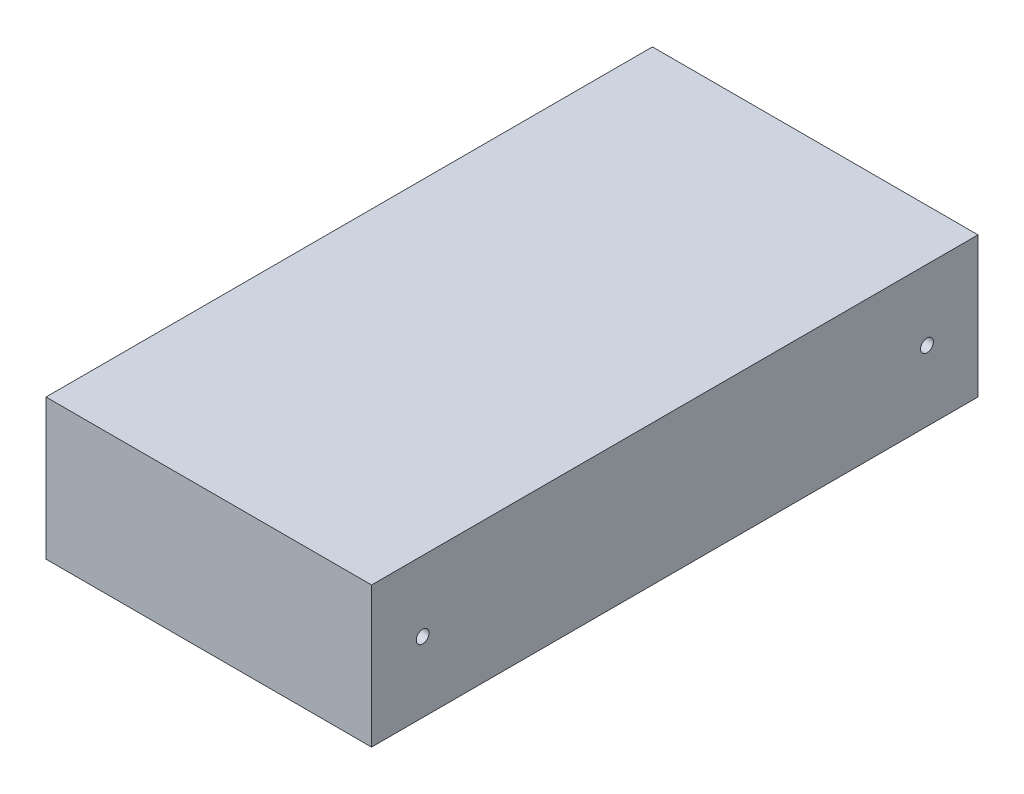
ISO-10303-21;
HEADER;
FILE_DESCRIPTION(('STEP AP214'),'2;1');
FILE_NAME('part.step','',(''),(''),'','','');
FILE_SCHEMA(('AUTOMOTIVE_DESIGN { 1 0 10303 214 1 1 1 1 }'));
ENDSEC;
DATA;
#1=APPLICATION_CONTEXT('core data for automotive mechanical design processes');
#2=APPLICATION_PROTOCOL_DEFINITION('international standard','automotive_design',2000,#1);
#3=PRODUCT_CONTEXT('',#1,'mechanical');
#4=PRODUCT('Part','Part','',(#3));
#5=PRODUCT_RELATED_PRODUCT_CATEGORY('part','',(#4));
#6=PRODUCT_DEFINITION_FORMATION('','',#4);
#7=PRODUCT_DEFINITION_CONTEXT('part definition',#1,'design');
#8=PRODUCT_DEFINITION('design','',#6,#7);
#9=PRODUCT_DEFINITION_SHAPE('','',#8);
#10=(LENGTH_UNIT() NAMED_UNIT(*) SI_UNIT(.MILLI.,.METRE.));
#11=(NAMED_UNIT(*) PLANE_ANGLE_UNIT() SI_UNIT($,.RADIAN.));
#12=(NAMED_UNIT(*) SI_UNIT($,.STERADIAN.) SOLID_ANGLE_UNIT());
#13=UNCERTAINTY_MEASURE_WITH_UNIT(LENGTH_MEASURE(1.E-05),#10,'distance_accuracy_value','');
#14=(GEOMETRIC_REPRESENTATION_CONTEXT(3) GLOBAL_UNCERTAINTY_ASSIGNED_CONTEXT((#13)) GLOBAL_UNIT_ASSIGNED_CONTEXT((#10,
#11,#12)) REPRESENTATION_CONTEXT('',''));
#15=CARTESIAN_POINT('',(0.,0.,0.));
#16=DIRECTION('',(0.,0.,1.));
#17=DIRECTION('',(1.,0.,0.));
#18=AXIS2_PLACEMENT_3D('',#15,#16,#17);
#19=CARTESIAN_POINT('',(-25.5,22.,47.5));
#20=DIRECTION('',(0.,0.,-1.));
#21=DIRECTION('',(-1.,0.,0.));
#22=AXIS2_PLACEMENT_3D('',#19,#20,#21);
#23=PLANE('',#22);
#24=DIRECTION('',(1.,0.,0.));
#25=VECTOR('',#24,1.);
#26=CARTESIAN_POINT('',(-25.5,0.,47.5));
#27=LINE('',#26,#25);
#28=CARTESIAN_POINT('',(-25.5,0.,47.5));
#29=VERTEX_POINT('',#28);
#30=CARTESIAN_POINT('',(25.5,0.,47.5));
#31=VERTEX_POINT('',#30);
#32=EDGE_CURVE('E107',#29,#31,#27,.T.);
#33=ORIENTED_EDGE('',*,*,#32,.T.);
#34=DIRECTION('',(0.,-1.,0.));
#35=VECTOR('',#34,1.);
#36=CARTESIAN_POINT('',(25.5,22.,47.5));
#37=LINE('',#36,#35);
#38=CARTESIAN_POINT('',(25.5,22.,47.5));
#39=VERTEX_POINT('',#38);
#40=EDGE_CURVE('E11',#39,#31,#37,.T.);
#41=ORIENTED_EDGE('',*,*,#40,.F.);
#42=DIRECTION('',(1.,0.,0.));
#43=VECTOR('',#42,1.);
#44=CARTESIAN_POINT('',(-25.5,22.,47.5));
#45=LINE('',#44,#43);
#46=CARTESIAN_POINT('',(-25.5,22.,47.5));
#47=VERTEX_POINT('',#46);
#48=EDGE_CURVE('E91',#47,#39,#45,.T.);
#49=ORIENTED_EDGE('',*,*,#48,.F.);
#50=DIRECTION('',(0.,-1.,0.));
#51=VECTOR('',#50,1.);
#52=CARTESIAN_POINT('',(-25.5,22.,47.5));
#53=LINE('',#52,#51);
#54=EDGE_CURVE('E103',#47,#29,#53,.T.);
#55=ORIENTED_EDGE('',*,*,#54,.T.);
#56=EDGE_LOOP('',(#33,#41,#49,#55));
#57=FACE_BOUND('',#56,.T.);
#58=ADVANCED_FACE('F39',(#57),#23,.F.);
#59=CARTESIAN_POINT('',(25.5,22.,47.5));
#60=DIRECTION('',(-1.,0.,0.));
#61=DIRECTION('',(0.,0.,1.));
#62=AXIS2_PLACEMENT_3D('',#59,#60,#61);
#63=PLANE('',#62);
#64=CARTESIAN_POINT('',(25.5,11.,-39.5));
#65=DIRECTION('',(-1.,0.,0.));
#66=DIRECTION('',(0.,0.,1.));
#67=AXIS2_PLACEMENT_3D('',#64,#65,#66);
#68=CIRCLE('',#67,0.999999999999998);
#69=CARTESIAN_POINT('',(25.5,11.,-38.5));
#70=VERTEX_POINT('',#69);
#71=EDGE_CURVE('E135',#70,#70,#68,.T.);
#72=ORIENTED_EDGE('',*,*,#71,.T.);
#73=EDGE_LOOP('',(#72));
#74=FACE_BOUND('',#73,.T.);
#75=CARTESIAN_POINT('',(25.5,11.,39.5));
#76=DIRECTION('',(1.,0.,0.));
#77=DIRECTION('',(0.,0.,-1.));
#78=AXIS2_PLACEMENT_3D('',#75,#76,#77);
#79=CIRCLE('',#78,0.999999999999998);
#80=CARTESIAN_POINT('',(25.5,11.,38.5));
#81=VERTEX_POINT('',#80);
#82=EDGE_CURVE('E131',#81,#81,#79,.T.);
#83=ORIENTED_EDGE('',*,*,#82,.F.);
#84=EDGE_LOOP('',(#83));
#85=FACE_BOUND('',#84,.T.);
#86=DIRECTION('',(0.,0.,-1.));
#87=VECTOR('',#86,1.);
#88=CARTESIAN_POINT('',(25.5,0.,47.5));
#89=LINE('',#88,#87);
#90=CARTESIAN_POINT('',(25.5,0.,-47.5));
#91=VERTEX_POINT('',#90);
#92=EDGE_CURVE('E96',#31,#91,#89,.T.);
#93=ORIENTED_EDGE('',*,*,#92,.T.);
#94=DIRECTION('',(0.,-1.,0.));
#95=VECTOR('',#94,1.);
#96=CARTESIAN_POINT('',(25.5,22.,-47.5));
#97=LINE('',#96,#95);
#98=CARTESIAN_POINT('',(25.5,22.,-47.5));
#99=VERTEX_POINT('',#98);
#100=EDGE_CURVE('E48',#99,#91,#97,.T.);
#101=ORIENTED_EDGE('',*,*,#100,.F.);
#102=DIRECTION('',(0.,0.,-1.));
#103=VECTOR('',#102,1.);
#104=CARTESIAN_POINT('',(25.5,22.,47.5));
#105=LINE('',#104,#103);
#106=EDGE_CURVE('E86',#39,#99,#105,.T.);
#107=ORIENTED_EDGE('',*,*,#106,.F.);
#108=ORIENTED_EDGE('',*,*,#40,.T.);
#109=EDGE_LOOP('',(#93,#101,#107,#108));
#110=FACE_BOUND('',#109,.T.);
#111=ADVANCED_FACE('F95',(#74,#85,#110),#63,.F.);
#112=CARTESIAN_POINT('',(-25.5,22.,-47.5));
#113=DIRECTION('',(0.,0.,1.));
#114=DIRECTION('',(1.,0.,0.));
#115=AXIS2_PLACEMENT_3D('',#112,#113,#114);
#116=PLANE('',#115);
#117=DIRECTION('',(-1.,0.,0.));
#118=VECTOR('',#117,1.);
#119=CARTESIAN_POINT('',(-25.5,0.,-47.5));
#120=LINE('',#119,#118);
#121=CARTESIAN_POINT('',(-25.5,0.,-47.5));
#122=VERTEX_POINT('',#121);
#123=EDGE_CURVE('E73',#91,#122,#120,.T.);
#124=ORIENTED_EDGE('',*,*,#123,.T.);
#125=DIRECTION('',(0.,-1.,0.));
#126=VECTOR('',#125,1.);
#127=CARTESIAN_POINT('',(-25.5,22.,-47.5));
#128=LINE('',#127,#126);
#129=CARTESIAN_POINT('',(-25.5,22.,-47.5));
#130=VERTEX_POINT('',#129);
#131=EDGE_CURVE('E98',#130,#122,#128,.T.);
#132=ORIENTED_EDGE('',*,*,#131,.F.);
#133=DIRECTION('',(-1.,0.,0.));
#134=VECTOR('',#133,1.);
#135=CARTESIAN_POINT('',(-25.5,22.,-47.5));
#136=LINE('',#135,#134);
#137=EDGE_CURVE('E89',#99,#130,#136,.T.);
#138=ORIENTED_EDGE('',*,*,#137,.F.);
#139=ORIENTED_EDGE('',*,*,#100,.T.);
#140=EDGE_LOOP('',(#124,#132,#138,#139));
#141=FACE_BOUND('',#140,.T.);
#142=ADVANCED_FACE('F99',(#141),#116,.F.);
#143=CARTESIAN_POINT('',(-25.5,22.,47.5));
#144=DIRECTION('',(1.,0.,0.));
#145=DIRECTION('',(0.,0.,-1.));
#146=AXIS2_PLACEMENT_3D('',#143,#144,#145);
#147=PLANE('',#146);
#148=CARTESIAN_POINT('',(-25.5,11.,-39.5));
#149=DIRECTION('',(1.,0.,0.));
#150=DIRECTION('',(0.,0.,-1.));
#151=AXIS2_PLACEMENT_3D('',#148,#149,#150);
#152=CIRCLE('',#151,0.999999999999998);
#153=CARTESIAN_POINT('',(-25.5,11.,-40.5));
#154=VERTEX_POINT('',#153);
#155=EDGE_CURVE('E136',#154,#154,#152,.T.);
#156=ORIENTED_EDGE('',*,*,#155,.T.);
#157=EDGE_LOOP('',(#156));
#158=FACE_BOUND('',#157,.T.);
#159=CARTESIAN_POINT('',(-25.5,11.,39.5));
#160=DIRECTION('',(1.,0.,0.));
#161=DIRECTION('',(0.,0.,-1.));
#162=AXIS2_PLACEMENT_3D('',#159,#160,#161);
#163=CIRCLE('',#162,0.999999999999998);
#164=CARTESIAN_POINT('',(-25.5,11.,38.5));
#165=VERTEX_POINT('',#164);
#166=EDGE_CURVE('E111',#165,#165,#163,.F.);
#167=ORIENTED_EDGE('',*,*,#166,.F.);
#168=EDGE_LOOP('',(#167));
#169=FACE_BOUND('',#168,.T.);
#170=DIRECTION('',(0.,0.,1.));
#171=VECTOR('',#170,1.);
#172=CARTESIAN_POINT('',(-25.5,0.,47.5));
#173=LINE('',#172,#171);
#174=EDGE_CURVE('E79',#122,#29,#173,.T.);
#175=ORIENTED_EDGE('',*,*,#174,.T.);
#176=ORIENTED_EDGE('',*,*,#54,.F.);
#177=DIRECTION('',(0.,0.,1.));
#178=VECTOR('',#177,1.);
#179=CARTESIAN_POINT('',(-25.5,22.,47.5));
#180=LINE('',#179,#178);
#181=EDGE_CURVE('E56',#130,#47,#180,.T.);
#182=ORIENTED_EDGE('',*,*,#181,.F.);
#183=ORIENTED_EDGE('',*,*,#131,.T.);
#184=EDGE_LOOP('',(#175,#176,#182,#183));
#185=FACE_BOUND('',#184,.T.);
#186=ADVANCED_FACE('F121',(#158,#169,#185),#147,.F.);
#187=CARTESIAN_POINT('',(0.,22.,0.));
#188=DIRECTION('',(0.,1.,0.));
#189=DIRECTION('',(0.,0.,1.));
#190=AXIS2_PLACEMENT_3D('',#187,#188,#189);
#191=PLANE('',#190);
#192=ORIENTED_EDGE('',*,*,#48,.T.);
#193=ORIENTED_EDGE('',*,*,#106,.T.);
#194=ORIENTED_EDGE('',*,*,#137,.T.);
#195=ORIENTED_EDGE('',*,*,#181,.T.);
#196=EDGE_LOOP('',(#192,#193,#194,#195));
#197=FACE_BOUND('',#196,.T.);
#198=ADVANCED_FACE('F87',(#197),#191,.T.);
#199=CARTESIAN_POINT('',(0.,0.,0.));
#200=DIRECTION('',(0.,1.,0.));
#201=DIRECTION('',(0.,0.,1.));
#202=AXIS2_PLACEMENT_3D('',#199,#200,#201);
#203=PLANE('',#202);
#204=ORIENTED_EDGE('',*,*,#32,.F.);
#205=ORIENTED_EDGE('',*,*,#174,.F.);
#206=ORIENTED_EDGE('',*,*,#123,.F.);
#207=ORIENTED_EDGE('',*,*,#92,.F.);
#208=EDGE_LOOP('',(#204,#205,#206,#207));
#209=FACE_BOUND('',#208,.T.);
#210=ADVANCED_FACE('F124',(#209),#203,.F.);
#211=CARTESIAN_POINT('',(-25.501,11.,39.5));
#212=DIRECTION('',(1.,0.,0.));
#213=DIRECTION('',(0.,0.,-1.));
#214=AXIS2_PLACEMENT_3D('',#211,#212,#213);
#215=CYLINDRICAL_SURFACE('',#214,0.999999999999998);
#216=ORIENTED_EDGE('',*,*,#82,.T.);
#217=EDGE_LOOP('',(#216));
#218=FACE_BOUND('',#217,.T.);
#219=ORIENTED_EDGE('',*,*,#166,.T.);
#220=EDGE_LOOP('',(#219));
#221=FACE_BOUND('',#220,.T.);
#222=ADVANCED_FACE('F149',(#218,#221),#215,.F.);
#223=CARTESIAN_POINT('',(-25.501,11.,-39.5));
#224=DIRECTION('',(1.,0.,0.));
#225=DIRECTION('',(0.,0.,-1.));
#226=AXIS2_PLACEMENT_3D('',#223,#224,#225);
#227=CYLINDRICAL_SURFACE('',#226,0.999999999999998);
#228=ORIENTED_EDGE('',*,*,#71,.F.);
#229=EDGE_LOOP('',(#228));
#230=FACE_BOUND('',#229,.T.);
#231=ORIENTED_EDGE('',*,*,#155,.F.);
#232=EDGE_LOOP('',(#231));
#233=FACE_BOUND('',#232,.T.);
#234=ADVANCED_FACE('F146',(#230,#233),#227,.F.);
#235=CLOSED_SHELL('',(#58,#111,#142,#186,#198,#210,#222,#234));
#236=MANIFOLD_SOLID_BREP('B2',#235);
#237=ADVANCED_BREP_SHAPE_REPRESENTATION('',(#18,#236),#14);
#238=SHAPE_DEFINITION_REPRESENTATION(#9,#237);
ENDSEC;
END-ISO-10303-21;
